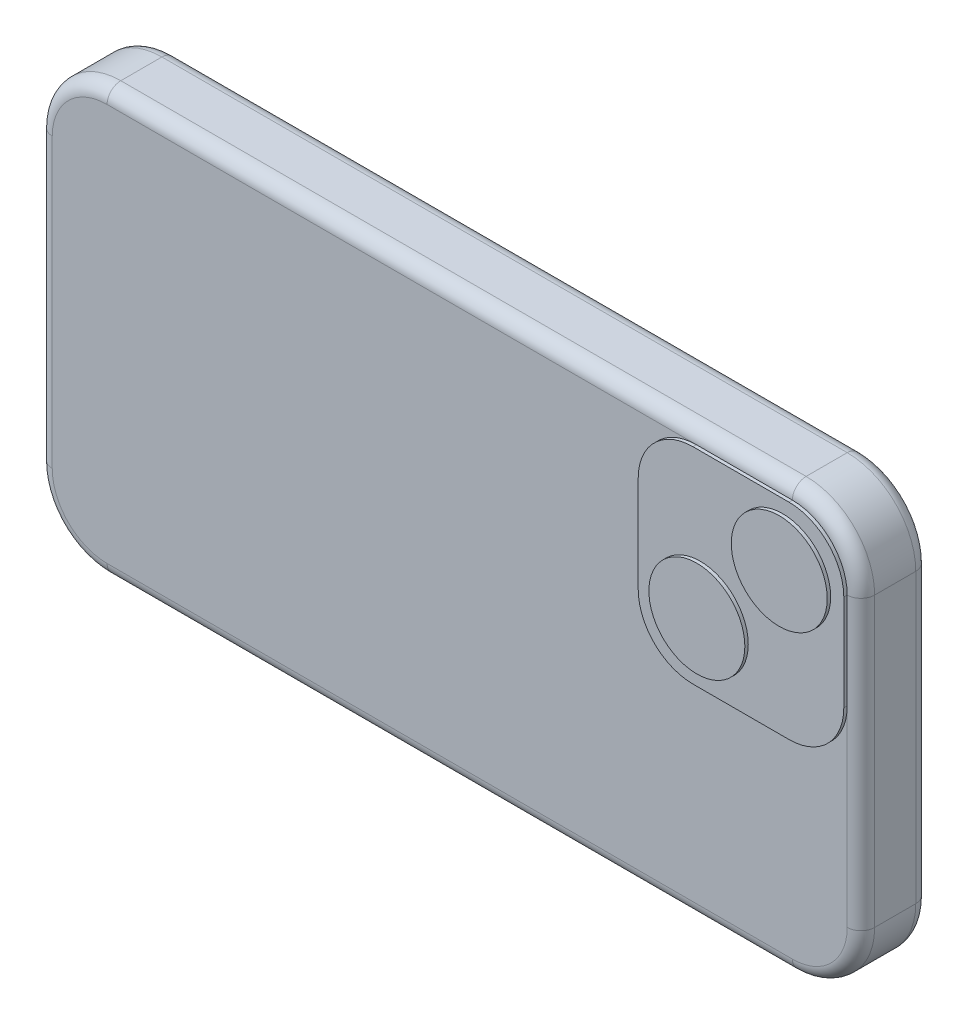
ISO-10303-21;
HEADER;
FILE_DESCRIPTION(('STEP AP214'),'2;1');
FILE_NAME('part.step','',(''),(''),'','','');
FILE_SCHEMA(('AUTOMOTIVE_DESIGN { 1 0 10303 214 1 1 1 1 }'));
ENDSEC;
DATA;
#1=APPLICATION_CONTEXT('core data for automotive mechanical design processes');
#2=APPLICATION_PROTOCOL_DEFINITION('international standard','automotive_design',2000,#1);
#3=PRODUCT_CONTEXT('',#1,'mechanical');
#4=PRODUCT('Part','Part','',(#3));
#5=PRODUCT_RELATED_PRODUCT_CATEGORY('part','',(#4));
#6=PRODUCT_DEFINITION_FORMATION('','',#4);
#7=PRODUCT_DEFINITION_CONTEXT('part definition',#1,'design');
#8=PRODUCT_DEFINITION('design','',#6,#7);
#9=PRODUCT_DEFINITION_SHAPE('','',#8);
#10=(LENGTH_UNIT() NAMED_UNIT(*) SI_UNIT(.MILLI.,.METRE.));
#11=(NAMED_UNIT(*) PLANE_ANGLE_UNIT() SI_UNIT($,.RADIAN.));
#12=(NAMED_UNIT(*) SI_UNIT($,.STERADIAN.) SOLID_ANGLE_UNIT());
#13=UNCERTAINTY_MEASURE_WITH_UNIT(LENGTH_MEASURE(1.E-05),#10,'distance_accuracy_value','');
#14=(GEOMETRIC_REPRESENTATION_CONTEXT(3) GLOBAL_UNCERTAINTY_ASSIGNED_CONTEXT((#13)) GLOBAL_UNIT_ASSIGNED_CONTEXT((#10,
#11,#12)) REPRESENTATION_CONTEXT('',''));
#15=CARTESIAN_POINT('',(0.,0.,0.));
#16=DIRECTION('',(0.,0.,1.));
#17=DIRECTION('',(1.,0.,0.));
#18=AXIS2_PLACEMENT_3D('',#15,#16,#17);
#19=CARTESIAN_POINT('',(76.2,-39.37,6.35));
#20=DIRECTION('',(-1.,0.,0.));
#21=DIRECTION('',(0.,0.,1.));
#22=AXIS2_PLACEMENT_3D('',#19,#20,#21);
#23=PLANE('',#22);
#24=DIRECTION('',(0.,0.,-1.));
#25=VECTOR('',#24,1.);
#26=CARTESIAN_POINT('',(76.2,-26.67,6.35));
#27=LINE('',#26,#25);
#28=CARTESIAN_POINT('',(76.2,-26.67,3.81));
#29=VERTEX_POINT('',#28);
#30=CARTESIAN_POINT('',(76.2,-26.67,-3.81));
#31=VERTEX_POINT('',#30);
#32=EDGE_CURVE('E249',#29,#31,#27,.T.);
#33=ORIENTED_EDGE('',*,*,#32,.T.);
#34=DIRECTION('',(0.,1.,0.));
#35=VECTOR('',#34,1.);
#36=CARTESIAN_POINT('',(76.2,26.67,-3.81));
#37=LINE('',#36,#35);
#38=CARTESIAN_POINT('',(76.2,26.67,-3.81));
#39=VERTEX_POINT('',#38);
#40=EDGE_CURVE('E333',#31,#39,#37,.T.);
#41=ORIENTED_EDGE('',*,*,#40,.T.);
#42=DIRECTION('',(0.,0.,-1.));
#43=VECTOR('',#42,1.);
#44=CARTESIAN_POINT('',(76.2,26.67,6.35));
#45=LINE('',#44,#43);
#46=CARTESIAN_POINT('',(76.2,26.67,3.81));
#47=VERTEX_POINT('',#46);
#48=EDGE_CURVE('E253',#39,#47,#45,.F.);
#49=ORIENTED_EDGE('',*,*,#48,.T.);
#50=DIRECTION('',(0.,1.,0.));
#51=VECTOR('',#50,1.);
#52=CARTESIAN_POINT('',(76.2,-39.37,3.81));
#53=LINE('',#52,#51);
#54=EDGE_CURVE('E330',#47,#29,#53,.F.);
#55=ORIENTED_EDGE('',*,*,#54,.T.);
#56=EDGE_LOOP('',(#33,#41,#49,#55));
#57=FACE_BOUND('',#56,.T.);
#58=ADVANCED_FACE('F47',(#57),#23,.F.);
#59=CARTESIAN_POINT('',(-76.2,39.37,6.35));
#60=DIRECTION('',(0.,-1.,0.));
#61=DIRECTION('',(0.,0.,-1.));
#62=AXIS2_PLACEMENT_3D('',#59,#60,#61);
#63=PLANE('',#62);
#64=DIRECTION('',(0.,0.,-1.));
#65=VECTOR('',#64,1.);
#66=CARTESIAN_POINT('',(63.5,39.37,6.35));
#67=LINE('',#66,#65);
#68=CARTESIAN_POINT('',(63.5,39.37,3.81));
#69=VERTEX_POINT('',#68);
#70=CARTESIAN_POINT('',(63.5,39.37,-3.81));
#71=VERTEX_POINT('',#70);
#72=EDGE_CURVE('E244',#69,#71,#67,.T.);
#73=ORIENTED_EDGE('',*,*,#72,.T.);
#74=DIRECTION('',(-1.,0.,0.));
#75=VECTOR('',#74,1.);
#76=CARTESIAN_POINT('',(-63.5,39.37,-3.81));
#77=LINE('',#76,#75);
#78=CARTESIAN_POINT('',(-63.5,39.37,-3.81));
#79=VERTEX_POINT('',#78);
#80=EDGE_CURVE('E345',#71,#79,#77,.T.);
#81=ORIENTED_EDGE('',*,*,#80,.T.);
#82=DIRECTION('',(0.,0.,-1.));
#83=VECTOR('',#82,1.);
#84=CARTESIAN_POINT('',(-63.5,39.37,6.35));
#85=LINE('',#84,#83);
#86=CARTESIAN_POINT('',(-63.5,39.37,3.81));
#87=VERTEX_POINT('',#86);
#88=EDGE_CURVE('E240',#79,#87,#85,.F.);
#89=ORIENTED_EDGE('',*,*,#88,.T.);
#90=DIRECTION('',(-1.,0.,0.));
#91=VECTOR('',#90,1.);
#92=CARTESIAN_POINT('',(-76.2,39.37,3.81));
#93=LINE('',#92,#91);
#94=EDGE_CURVE('E342',#87,#69,#93,.F.);
#95=ORIENTED_EDGE('',*,*,#94,.T.);
#96=EDGE_LOOP('',(#73,#81,#89,#95));
#97=FACE_BOUND('',#96,.T.);
#98=ADVANCED_FACE('F586',(#97),#63,.F.);
#99=CARTESIAN_POINT('',(-76.2,-39.37,6.35));
#100=DIRECTION('',(1.,0.,0.));
#101=DIRECTION('',(0.,0.,-1.));
#102=AXIS2_PLACEMENT_3D('',#99,#100,#101);
#103=PLANE('',#102);
#104=DIRECTION('',(0.,0.,-1.));
#105=VECTOR('',#104,1.);
#106=CARTESIAN_POINT('',(-76.2,26.67,6.35));
#107=LINE('',#106,#105);
#108=CARTESIAN_POINT('',(-76.2,26.67,3.81));
#109=VERTEX_POINT('',#108);
#110=CARTESIAN_POINT('',(-76.2,26.67,-3.81));
#111=VERTEX_POINT('',#110);
#112=EDGE_CURVE('E265',#109,#111,#107,.T.);
#113=ORIENTED_EDGE('',*,*,#112,.T.);
#114=DIRECTION('',(0.,-1.,0.));
#115=VECTOR('',#114,1.);
#116=CARTESIAN_POINT('',(-76.2,-26.67,-3.81));
#117=LINE('',#116,#115);
#118=CARTESIAN_POINT('',(-76.2,-26.67,-3.81));
#119=VERTEX_POINT('',#118);
#120=EDGE_CURVE('E308',#111,#119,#117,.T.);
#121=ORIENTED_EDGE('',*,*,#120,.T.);
#122=DIRECTION('',(0.,0.,-1.));
#123=VECTOR('',#122,1.);
#124=CARTESIAN_POINT('',(-76.2,-26.67,6.35));
#125=LINE('',#124,#123);
#126=CARTESIAN_POINT('',(-76.2,-26.67,3.81));
#127=VERTEX_POINT('',#126);
#128=EDGE_CURVE('E269',#119,#127,#125,.F.);
#129=ORIENTED_EDGE('',*,*,#128,.T.);
#130=DIRECTION('',(0.,-1.,0.));
#131=VECTOR('',#130,1.);
#132=CARTESIAN_POINT('',(-76.2,-39.37,3.81));
#133=LINE('',#132,#131);
#134=EDGE_CURVE('E305',#127,#109,#133,.F.);
#135=ORIENTED_EDGE('',*,*,#134,.T.);
#136=EDGE_LOOP('',(#113,#121,#129,#135));
#137=FACE_BOUND('',#136,.T.);
#138=ADVANCED_FACE('F606',(#137),#103,.F.);
#139=CARTESIAN_POINT('',(-76.2,-39.37,6.35));
#140=DIRECTION('',(0.,1.,0.));
#141=DIRECTION('',(0.,0.,1.));
#142=AXIS2_PLACEMENT_3D('',#139,#140,#141);
#143=PLANE('',#142);
#144=DIRECTION('',(0.,0.,-1.));
#145=VECTOR('',#144,1.);
#146=CARTESIAN_POINT('',(-63.5,-39.37,6.35));
#147=LINE('',#146,#145);
#148=CARTESIAN_POINT('',(-63.5,-39.37,3.81));
#149=VERTEX_POINT('',#148);
#150=CARTESIAN_POINT('',(-63.5,-39.37,-3.81));
#151=VERTEX_POINT('',#150);
#152=EDGE_CURVE('E257',#149,#151,#147,.T.);
#153=ORIENTED_EDGE('',*,*,#152,.T.);
#154=DIRECTION('',(1.,0.,0.));
#155=VECTOR('',#154,1.);
#156=CARTESIAN_POINT('',(63.4999999999999,-39.37,-3.81));
#157=LINE('',#156,#155);
#158=CARTESIAN_POINT('',(63.5,-39.37,-3.81));
#159=VERTEX_POINT('',#158);
#160=EDGE_CURVE('E320',#151,#159,#157,.T.);
#161=ORIENTED_EDGE('',*,*,#160,.T.);
#162=DIRECTION('',(0.,0.,-1.));
#163=VECTOR('',#162,1.);
#164=CARTESIAN_POINT('',(63.5,-39.37,6.35));
#165=LINE('',#164,#163);
#166=CARTESIAN_POINT('',(63.5,-39.37,3.81));
#167=VERTEX_POINT('',#166);
#168=EDGE_CURVE('E261',#159,#167,#165,.F.);
#169=ORIENTED_EDGE('',*,*,#168,.T.);
#170=DIRECTION('',(1.,0.,0.));
#171=VECTOR('',#170,1.);
#172=CARTESIAN_POINT('',(-76.2,-39.37,3.81));
#173=LINE('',#172,#171);
#174=EDGE_CURVE('E317',#167,#149,#173,.F.);
#175=ORIENTED_EDGE('',*,*,#174,.T.);
#176=EDGE_LOOP('',(#153,#161,#169,#175));
#177=FACE_BOUND('',#176,.T.);
#178=ADVANCED_FACE('F872',(#177),#143,.F.);
#179=CARTESIAN_POINT('',(0.,0.,6.35));
#180=DIRECTION('',(0.,0.,-1.));
#181=DIRECTION('',(-1.,0.,0.));
#182=AXIS2_PLACEMENT_3D('',#179,#180,#181);
#183=PLANE('',#182);
#184=CARTESIAN_POINT('',(45.72,26.67,6.35));
#185=DIRECTION('',(0.,0.,-1.));
#186=DIRECTION('',(-1.,0.,0.));
#187=AXIS2_PLACEMENT_3D('',#184,#185,#186);
#188=CIRCLE('',#187,10.16);
#189=CARTESIAN_POINT('',(45.72,36.83,6.35));
#190=VERTEX_POINT('',#189);
#191=CARTESIAN_POINT('',(35.56,26.6699999999999,6.35));
#192=VERTEX_POINT('',#191);
#193=EDGE_CURVE('E231',#190,#192,#188,.F.);
#194=ORIENTED_EDGE('',*,*,#193,.F.);
#195=DIRECTION('',(-1.,0.,0.));
#196=VECTOR('',#195,1.);
#197=CARTESIAN_POINT('',(0.,36.83,6.35));
#198=LINE('',#197,#196);
#199=CARTESIAN_POINT('',(-63.5,36.83,6.35));
#200=VERTEX_POINT('',#199);
#201=EDGE_CURVE('E357',#190,#200,#198,.T.);
#202=ORIENTED_EDGE('',*,*,#201,.T.);
#203=CARTESIAN_POINT('',(-63.5,26.67,6.35));
#204=DIRECTION('',(0.,0.,-1.));
#205=DIRECTION('',(-1.,0.,0.));
#206=AXIS2_PLACEMENT_3D('',#203,#204,#205);
#207=CIRCLE('',#206,10.16);
#208=CARTESIAN_POINT('',(-73.66,26.67,6.35));
#209=VERTEX_POINT('',#208);
#210=EDGE_CURVE('E360',#200,#209,#207,.F.);
#211=ORIENTED_EDGE('',*,*,#210,.T.);
#212=DIRECTION('',(0.,-1.,0.));
#213=VECTOR('',#212,1.);
#214=CARTESIAN_POINT('',(-73.66,0.,6.35));
#215=LINE('',#214,#213);
#216=CARTESIAN_POINT('',(-73.66,-26.67,6.35));
#217=VERTEX_POINT('',#216);
#218=EDGE_CURVE('E363',#209,#217,#215,.T.);
#219=ORIENTED_EDGE('',*,*,#218,.T.);
#220=CARTESIAN_POINT('',(-63.5,-26.67,6.35));
#221=DIRECTION('',(0.,0.,-1.));
#222=DIRECTION('',(-1.,0.,0.));
#223=AXIS2_PLACEMENT_3D('',#220,#221,#222);
#224=CIRCLE('',#223,10.16);
#225=CARTESIAN_POINT('',(-63.5,-36.83,6.35));
#226=VERTEX_POINT('',#225);
#227=EDGE_CURVE('E366',#217,#226,#224,.F.);
#228=ORIENTED_EDGE('',*,*,#227,.T.);
#229=DIRECTION('',(1.,0.,0.));
#230=VECTOR('',#229,1.);
#231=CARTESIAN_POINT('',(0.,-36.83,6.35));
#232=LINE('',#231,#230);
#233=CARTESIAN_POINT('',(63.5,-36.83,6.35));
#234=VERTEX_POINT('',#233);
#235=EDGE_CURVE('E369',#226,#234,#232,.T.);
#236=ORIENTED_EDGE('',*,*,#235,.T.);
#237=CARTESIAN_POINT('',(63.5,-26.67,6.35));
#238=DIRECTION('',(0.,0.,-1.));
#239=DIRECTION('',(-1.,0.,0.));
#240=AXIS2_PLACEMENT_3D('',#237,#238,#239);
#241=CIRCLE('',#240,10.16);
#242=CARTESIAN_POINT('',(73.66,-26.67,6.35));
#243=VERTEX_POINT('',#242);
#244=EDGE_CURVE('E372',#234,#243,#241,.F.);
#245=ORIENTED_EDGE('',*,*,#244,.T.);
#246=DIRECTION('',(0.,1.,0.));
#247=VECTOR('',#246,1.);
#248=CARTESIAN_POINT('',(73.66,0.,6.35));
#249=LINE('',#248,#247);
#250=CARTESIAN_POINT('',(73.66,8.89000000000007,6.35));
#251=VERTEX_POINT('',#250);
#252=EDGE_CURVE('E349',#243,#251,#249,.T.);
#253=ORIENTED_EDGE('',*,*,#252,.T.);
#254=CARTESIAN_POINT('',(63.5,8.89000000000001,6.35));
#255=DIRECTION('',(0.,0.,-1.));
#256=DIRECTION('',(-1.,0.,0.));
#257=AXIS2_PLACEMENT_3D('',#254,#255,#256);
#258=CIRCLE('',#257,10.16);
#259=CARTESIAN_POINT('',(63.4999999999999,-1.27,6.35));
#260=VERTEX_POINT('',#259);
#261=EDGE_CURVE('E227',#251,#260,#258,.T.);
#262=ORIENTED_EDGE('',*,*,#261,.T.);
#263=DIRECTION('',(-1.,0.,0.));
#264=VECTOR('',#263,1.);
#265=CARTESIAN_POINT('',(0.,-1.27,6.35));
#266=LINE('',#265,#264);
#267=CARTESIAN_POINT('',(45.72,-1.27,6.35));
#268=VERTEX_POINT('',#267);
#269=EDGE_CURVE('E376',#260,#268,#266,.T.);
#270=ORIENTED_EDGE('',*,*,#269,.T.);
#271=CARTESIAN_POINT('',(45.72,8.89,6.35));
#272=DIRECTION('',(0.,0.,-1.));
#273=DIRECTION('',(-1.,0.,0.));
#274=AXIS2_PLACEMENT_3D('',#271,#272,#273);
#275=CIRCLE('',#274,10.16);
#276=CARTESIAN_POINT('',(35.56,8.89,6.35));
#277=VERTEX_POINT('',#276);
#278=EDGE_CURVE('E57',#277,#268,#275,.F.);
#279=ORIENTED_EDGE('',*,*,#278,.F.);
#280=DIRECTION('',(0.,-1.,0.));
#281=VECTOR('',#280,1.);
#282=CARTESIAN_POINT('',(35.56,0.,6.35));
#283=LINE('',#282,#281);
#284=EDGE_CURVE('E11',#192,#277,#283,.T.);
#285=ORIENTED_EDGE('',*,*,#284,.F.);
#286=EDGE_LOOP('',(#194,#202,#211,#219,#228,#236,#245,#253,#262,#270,#279,#285));
#287=FACE_BOUND('',#286,.T.);
#288=ADVANCED_FACE('F527',(#287),#183,.F.);
#289=CARTESIAN_POINT('',(0.,0.,-6.35));
#290=DIRECTION('',(0.,0.,-1.));
#291=DIRECTION('',(-1.,0.,0.));
#292=AXIS2_PLACEMENT_3D('',#289,#290,#291);
#293=PLANE('',#292);
#294=DIRECTION('',(0.,-1.,0.));
#295=VECTOR('',#294,1.);
#296=CARTESIAN_POINT('',(-73.66,26.67,-6.35));
#297=LINE('',#296,#295);
#298=CARTESIAN_POINT('',(-73.66,-26.67,-6.35));
#299=VERTEX_POINT('',#298);
#300=CARTESIAN_POINT('',(-73.66,26.67,-6.35));
#301=VERTEX_POINT('',#300);
#302=EDGE_CURVE('E291',#299,#301,#297,.F.);
#303=ORIENTED_EDGE('',*,*,#302,.T.);
#304=CARTESIAN_POINT('',(-63.5,26.67,-6.35));
#305=DIRECTION('',(0.,0.,-1.));
#306=DIRECTION('',(-1.,0.,0.));
#307=AXIS2_PLACEMENT_3D('',#304,#305,#306);
#308=CIRCLE('',#307,10.16);
#309=CARTESIAN_POINT('',(-63.5,36.83,-6.35));
#310=VERTEX_POINT('',#309);
#311=EDGE_CURVE('E294',#301,#310,#308,.T.);
#312=ORIENTED_EDGE('',*,*,#311,.T.);
#313=DIRECTION('',(-1.,0.,0.));
#314=VECTOR('',#313,1.);
#315=CARTESIAN_POINT('',(63.4999999999999,36.83,-6.35));
#316=LINE('',#315,#314);
#317=CARTESIAN_POINT('',(63.5,36.83,-6.35));
#318=VERTEX_POINT('',#317);
#319=EDGE_CURVE('E273',#310,#318,#316,.F.);
#320=ORIENTED_EDGE('',*,*,#319,.T.);
#321=CARTESIAN_POINT('',(63.5,26.67,-6.35));
#322=DIRECTION('',(0.,0.,-1.));
#323=DIRECTION('',(-1.,0.,0.));
#324=AXIS2_PLACEMENT_3D('',#321,#322,#323);
#325=CIRCLE('',#324,10.16);
#326=CARTESIAN_POINT('',(73.66,26.67,-6.35));
#327=VERTEX_POINT('',#326);
#328=EDGE_CURVE('E276',#318,#327,#325,.T.);
#329=ORIENTED_EDGE('',*,*,#328,.T.);
#330=DIRECTION('',(0.,1.,0.));
#331=VECTOR('',#330,1.);
#332=CARTESIAN_POINT('',(73.66,-26.67,-6.35));
#333=LINE('',#332,#331);
#334=CARTESIAN_POINT('',(73.66,-26.67,-6.35));
#335=VERTEX_POINT('',#334);
#336=EDGE_CURVE('E279',#327,#335,#333,.F.);
#337=ORIENTED_EDGE('',*,*,#336,.T.);
#338=CARTESIAN_POINT('',(63.5,-26.67,-6.35));
#339=DIRECTION('',(0.,0.,-1.));
#340=DIRECTION('',(-1.,0.,0.));
#341=AXIS2_PLACEMENT_3D('',#338,#339,#340);
#342=CIRCLE('',#341,10.16);
#343=CARTESIAN_POINT('',(63.5,-36.83,-6.35));
#344=VERTEX_POINT('',#343);
#345=EDGE_CURVE('E282',#335,#344,#342,.T.);
#346=ORIENTED_EDGE('',*,*,#345,.T.);
#347=DIRECTION('',(1.,0.,0.));
#348=VECTOR('',#347,1.);
#349=CARTESIAN_POINT('',(-63.5,-36.83,-6.35));
#350=LINE('',#349,#348);
#351=CARTESIAN_POINT('',(-63.5,-36.83,-6.35));
#352=VERTEX_POINT('',#351);
#353=EDGE_CURVE('E285',#344,#352,#350,.F.);
#354=ORIENTED_EDGE('',*,*,#353,.T.);
#355=CARTESIAN_POINT('',(-63.5,-26.67,-6.35));
#356=DIRECTION('',(0.,0.,-1.));
#357=DIRECTION('',(-1.,0.,0.));
#358=AXIS2_PLACEMENT_3D('',#355,#356,#357);
#359=CIRCLE('',#358,10.16);
#360=EDGE_CURVE('E288',#352,#299,#359,.T.);
#361=ORIENTED_EDGE('',*,*,#360,.T.);
#362=EDGE_LOOP('',(#303,#312,#320,#329,#337,#346,#354,#361));
#363=FACE_BOUND('',#362,.T.);
#364=ADVANCED_FACE('F574',(#363),#293,.T.);
#365=CARTESIAN_POINT('',(63.5,26.67,6.35));
#366=DIRECTION('',(0.,0.,-1.));
#367=DIRECTION('',(-1.,0.,0.));
#368=AXIS2_PLACEMENT_3D('',#365,#366,#367);
#369=CYLINDRICAL_SURFACE('',#368,12.7);
#370=ORIENTED_EDGE('',*,*,#48,.F.);
#371=CARTESIAN_POINT('',(63.5,26.67,-3.81));
#372=DIRECTION('',(0.,0.,-1.));
#373=DIRECTION('',(-1.,0.,0.));
#374=AXIS2_PLACEMENT_3D('',#371,#372,#373);
#375=CIRCLE('',#374,12.7);
#376=EDGE_CURVE('E339',#39,#71,#375,.F.);
#377=ORIENTED_EDGE('',*,*,#376,.T.);
#378=ORIENTED_EDGE('',*,*,#72,.F.);
#379=CARTESIAN_POINT('',(63.5,26.67,3.81));
#380=DIRECTION('',(0.,0.,-1.));
#381=DIRECTION('',(-1.,0.,0.));
#382=AXIS2_PLACEMENT_3D('',#379,#380,#381);
#383=CIRCLE('',#382,12.7);
#384=EDGE_CURVE('E336',#69,#47,#383,.T.);
#385=ORIENTED_EDGE('',*,*,#384,.T.);
#386=EDGE_LOOP('',(#370,#377,#378,#385));
#387=FACE_BOUND('',#386,.T.);
#388=ADVANCED_FACE('F582',(#387),#369,.T.);
#389=CARTESIAN_POINT('',(63.5,-26.67,6.35));
#390=DIRECTION('',(0.,0.,-1.));
#391=DIRECTION('',(-1.,0.,0.));
#392=AXIS2_PLACEMENT_3D('',#389,#390,#391);
#393=CYLINDRICAL_SURFACE('',#392,12.7);
#394=ORIENTED_EDGE('',*,*,#168,.F.);
#395=CARTESIAN_POINT('',(63.5,-26.67,-3.81));
#396=DIRECTION('',(0.,0.,-1.));
#397=DIRECTION('',(-1.,0.,0.));
#398=AXIS2_PLACEMENT_3D('',#395,#396,#397);
#399=CIRCLE('',#398,12.7);
#400=EDGE_CURVE('E327',#159,#31,#399,.F.);
#401=ORIENTED_EDGE('',*,*,#400,.T.);
#402=ORIENTED_EDGE('',*,*,#32,.F.);
#403=CARTESIAN_POINT('',(63.5,-26.67,3.81));
#404=DIRECTION('',(0.,0.,-1.));
#405=DIRECTION('',(-1.,0.,0.));
#406=AXIS2_PLACEMENT_3D('',#403,#404,#405);
#407=CIRCLE('',#406,12.7);
#408=EDGE_CURVE('E323',#29,#167,#407,.T.);
#409=ORIENTED_EDGE('',*,*,#408,.T.);
#410=EDGE_LOOP('',(#394,#401,#402,#409));
#411=FACE_BOUND('',#410,.T.);
#412=ADVANCED_FACE('F560',(#411),#393,.T.);
#413=CARTESIAN_POINT('',(-63.5,-26.67,6.35));
#414=DIRECTION('',(0.,0.,-1.));
#415=DIRECTION('',(-1.,0.,0.));
#416=AXIS2_PLACEMENT_3D('',#413,#414,#415);
#417=CYLINDRICAL_SURFACE('',#416,12.7);
#418=ORIENTED_EDGE('',*,*,#128,.F.);
#419=CARTESIAN_POINT('',(-63.5,-26.67,-3.81));
#420=DIRECTION('',(0.,0.,-1.));
#421=DIRECTION('',(-1.,0.,0.));
#422=AXIS2_PLACEMENT_3D('',#419,#420,#421);
#423=CIRCLE('',#422,12.7);
#424=EDGE_CURVE('E314',#119,#151,#423,.F.);
#425=ORIENTED_EDGE('',*,*,#424,.T.);
#426=ORIENTED_EDGE('',*,*,#152,.F.);
#427=CARTESIAN_POINT('',(-63.5,-26.67,3.81));
#428=DIRECTION('',(0.,0.,-1.));
#429=DIRECTION('',(-1.,0.,0.));
#430=AXIS2_PLACEMENT_3D('',#427,#428,#429);
#431=CIRCLE('',#430,12.7);
#432=EDGE_CURVE('E311',#149,#127,#431,.T.);
#433=ORIENTED_EDGE('',*,*,#432,.T.);
#434=EDGE_LOOP('',(#418,#425,#426,#433));
#435=FACE_BOUND('',#434,.T.);
#436=ADVANCED_FACE('F610',(#435),#417,.T.);
#437=CARTESIAN_POINT('',(-63.5,26.67,6.35));
#438=DIRECTION('',(0.,0.,-1.));
#439=DIRECTION('',(-1.,0.,0.));
#440=AXIS2_PLACEMENT_3D('',#437,#438,#439);
#441=CYLINDRICAL_SURFACE('',#440,12.7);
#442=ORIENTED_EDGE('',*,*,#88,.F.);
#443=CARTESIAN_POINT('',(-63.5,26.67,-3.81));
#444=DIRECTION('',(0.,0.,-1.));
#445=DIRECTION('',(-1.,0.,0.));
#446=AXIS2_PLACEMENT_3D('',#443,#444,#445);
#447=CIRCLE('',#446,12.7);
#448=EDGE_CURVE('E301',#79,#111,#447,.F.);
#449=ORIENTED_EDGE('',*,*,#448,.T.);
#450=ORIENTED_EDGE('',*,*,#112,.F.);
#451=CARTESIAN_POINT('',(-63.5,26.67,3.81));
#452=DIRECTION('',(0.,0.,-1.));
#453=DIRECTION('',(-1.,0.,0.));
#454=AXIS2_PLACEMENT_3D('',#451,#452,#453);
#455=CIRCLE('',#454,12.7);
#456=EDGE_CURVE('E298',#109,#87,#455,.T.);
#457=ORIENTED_EDGE('',*,*,#456,.T.);
#458=EDGE_LOOP('',(#442,#449,#450,#457));
#459=FACE_BOUND('',#458,.T.);
#460=ADVANCED_FACE('F604',(#459),#441,.T.);
#461=CARTESIAN_POINT('',(63.5,-26.67,-3.81));
#462=DIRECTION('',(0.,0.,-1.));
#463=DIRECTION('',(-1.,0.,0.));
#464=AXIS2_PLACEMENT_3D('',#461,#462,#463);
#465=TOROIDAL_SURFACE('',#464,10.16,2.54);
#466=CARTESIAN_POINT('',(73.66,-26.67,-3.81));
#467=DIRECTION('',(0.,1.,0.));
#468=DIRECTION('',(0.,0.,1.));
#469=AXIS2_PLACEMENT_3D('',#466,#467,#468);
#470=CIRCLE('',#469,2.54);
#471=EDGE_CURVE('E400',#31,#335,#470,.T.);
#472=ORIENTED_EDGE('',*,*,#471,.F.);
#473=ORIENTED_EDGE('',*,*,#400,.F.);
#474=CARTESIAN_POINT('',(63.5,-36.83,-3.81));
#475=DIRECTION('',(-1.,0.,0.));
#476=DIRECTION('',(0.,0.,1.));
#477=AXIS2_PLACEMENT_3D('',#474,#475,#476);
#478=CIRCLE('',#477,2.54);
#479=EDGE_CURVE('E245',#344,#159,#478,.T.);
#480=ORIENTED_EDGE('',*,*,#479,.F.);
#481=ORIENTED_EDGE('',*,*,#345,.F.);
#482=EDGE_LOOP('',(#472,#473,#480,#481));
#483=FACE_BOUND('',#482,.T.);
#484=ADVANCED_FACE('F564',(#483),#465,.T.);
#485=CARTESIAN_POINT('',(-76.2,-36.83,-3.81));
#486=DIRECTION('',(-1.,0.,0.));
#487=DIRECTION('',(0.,0.,1.));
#488=AXIS2_PLACEMENT_3D('',#485,#486,#487);
#489=CYLINDRICAL_SURFACE('',#488,2.54);
#490=ORIENTED_EDGE('',*,*,#479,.T.);
#491=ORIENTED_EDGE('',*,*,#160,.F.);
#492=CARTESIAN_POINT('',(-63.5,-36.83,-3.81));
#493=DIRECTION('',(-1.,0.,0.));
#494=DIRECTION('',(0.,0.,1.));
#495=AXIS2_PLACEMENT_3D('',#492,#493,#494);
#496=CIRCLE('',#495,2.54);
#497=EDGE_CURVE('E396',#352,#151,#496,.T.);
#498=ORIENTED_EDGE('',*,*,#497,.F.);
#499=ORIENTED_EDGE('',*,*,#353,.F.);
#500=EDGE_LOOP('',(#490,#491,#498,#499));
#501=FACE_BOUND('',#500,.T.);
#502=ADVANCED_FACE('F570',(#501),#489,.T.);
#503=CARTESIAN_POINT('',(73.66,-39.37,-3.81));
#504=DIRECTION('',(0.,-1.,0.));
#505=DIRECTION('',(0.,0.,-1.));
#506=AXIS2_PLACEMENT_3D('',#503,#504,#505);
#507=CYLINDRICAL_SURFACE('',#506,2.54);
#508=ORIENTED_EDGE('',*,*,#471,.T.);
#509=ORIENTED_EDGE('',*,*,#336,.F.);
#510=CARTESIAN_POINT('',(73.66,26.67,-3.81));
#511=DIRECTION('',(0.,1.,0.));
#512=DIRECTION('',(0.,0.,1.));
#513=AXIS2_PLACEMENT_3D('',#510,#511,#512);
#514=CIRCLE('',#513,2.54);
#515=EDGE_CURVE('E392',#39,#327,#514,.T.);
#516=ORIENTED_EDGE('',*,*,#515,.F.);
#517=ORIENTED_EDGE('',*,*,#40,.F.);
#518=EDGE_LOOP('',(#508,#509,#516,#517));
#519=FACE_BOUND('',#518,.T.);
#520=ADVANCED_FACE('F578',(#519),#507,.T.);
#521=CARTESIAN_POINT('',(-63.5,-26.67,-3.81));
#522=DIRECTION('',(0.,0.,-1.));
#523=DIRECTION('',(-1.,0.,0.));
#524=AXIS2_PLACEMENT_3D('',#521,#522,#523);
#525=TOROIDAL_SURFACE('',#524,10.16,2.54);
#526=ORIENTED_EDGE('',*,*,#497,.T.);
#527=ORIENTED_EDGE('',*,*,#424,.F.);
#528=CARTESIAN_POINT('',(-73.66,-26.67,-3.81));
#529=DIRECTION('',(0.,1.,0.));
#530=DIRECTION('',(0.,0.,1.));
#531=AXIS2_PLACEMENT_3D('',#528,#529,#530);
#532=CIRCLE('',#531,2.54);
#533=EDGE_CURVE('E388',#299,#119,#532,.T.);
#534=ORIENTED_EDGE('',*,*,#533,.F.);
#535=ORIENTED_EDGE('',*,*,#360,.F.);
#536=EDGE_LOOP('',(#526,#527,#534,#535));
#537=FACE_BOUND('',#536,.T.);
#538=ADVANCED_FACE('F613',(#537),#525,.T.);
#539=CARTESIAN_POINT('',(63.5,26.67,-3.81));
#540=DIRECTION('',(0.,0.,-1.));
#541=DIRECTION('',(-1.,0.,0.));
#542=AXIS2_PLACEMENT_3D('',#539,#540,#541);
#543=TOROIDAL_SURFACE('',#542,10.16,2.54);
#544=ORIENTED_EDGE('',*,*,#515,.T.);
#545=ORIENTED_EDGE('',*,*,#328,.F.);
#546=CARTESIAN_POINT('',(63.5,36.83,-3.81));
#547=DIRECTION('',(-1.,0.,0.));
#548=DIRECTION('',(0.,0.,1.));
#549=AXIS2_PLACEMENT_3D('',#546,#547,#548);
#550=CIRCLE('',#549,2.54);
#551=EDGE_CURVE('E384',#71,#318,#550,.T.);
#552=ORIENTED_EDGE('',*,*,#551,.F.);
#553=ORIENTED_EDGE('',*,*,#376,.F.);
#554=EDGE_LOOP('',(#544,#545,#552,#553));
#555=FACE_BOUND('',#554,.T.);
#556=ADVANCED_FACE('F591',(#555),#543,.T.);
#557=CARTESIAN_POINT('',(-73.66,-39.37,-3.81));
#558=DIRECTION('',(0.,1.,0.));
#559=DIRECTION('',(0.,0.,1.));
#560=AXIS2_PLACEMENT_3D('',#557,#558,#559);
#561=CYLINDRICAL_SURFACE('',#560,2.54);
#562=ORIENTED_EDGE('',*,*,#533,.T.);
#563=ORIENTED_EDGE('',*,*,#120,.F.);
#564=CARTESIAN_POINT('',(-73.66,26.67,-3.81));
#565=DIRECTION('',(0.,1.,0.));
#566=DIRECTION('',(0.,0.,1.));
#567=AXIS2_PLACEMENT_3D('',#564,#565,#566);
#568=CIRCLE('',#567,2.54);
#569=EDGE_CURVE('E380',#301,#111,#568,.T.);
#570=ORIENTED_EDGE('',*,*,#569,.F.);
#571=ORIENTED_EDGE('',*,*,#302,.F.);
#572=EDGE_LOOP('',(#562,#563,#570,#571));
#573=FACE_BOUND('',#572,.T.);
#574=ADVANCED_FACE('F616',(#573),#561,.T.);
#575=CARTESIAN_POINT('',(-76.2,36.83,-3.81));
#576=DIRECTION('',(1.,0.,0.));
#577=DIRECTION('',(0.,0.,-1.));
#578=AXIS2_PLACEMENT_3D('',#575,#576,#577);
#579=CYLINDRICAL_SURFACE('',#578,2.54);
#580=ORIENTED_EDGE('',*,*,#551,.T.);
#581=ORIENTED_EDGE('',*,*,#319,.F.);
#582=CARTESIAN_POINT('',(-63.5,36.83,-3.81));
#583=DIRECTION('',(-1.,0.,0.));
#584=DIRECTION('',(0.,0.,1.));
#585=AXIS2_PLACEMENT_3D('',#582,#583,#584);
#586=CIRCLE('',#585,2.54);
#587=EDGE_CURVE('E377',#79,#310,#586,.T.);
#588=ORIENTED_EDGE('',*,*,#587,.F.);
#589=ORIENTED_EDGE('',*,*,#80,.F.);
#590=EDGE_LOOP('',(#580,#581,#588,#589));
#591=FACE_BOUND('',#590,.T.);
#592=ADVANCED_FACE('F595',(#591),#579,.T.);
#593=CARTESIAN_POINT('',(-63.5,26.67,-3.81));
#594=DIRECTION('',(0.,0.,-1.));
#595=DIRECTION('',(-1.,0.,0.));
#596=AXIS2_PLACEMENT_3D('',#593,#594,#595);
#597=TOROIDAL_SURFACE('',#596,10.16,2.54);
#598=ORIENTED_EDGE('',*,*,#569,.T.);
#599=ORIENTED_EDGE('',*,*,#448,.F.);
#600=ORIENTED_EDGE('',*,*,#587,.T.);
#601=ORIENTED_EDGE('',*,*,#311,.F.);
#602=EDGE_LOOP('',(#598,#599,#600,#601));
#603=FACE_BOUND('',#602,.T.);
#604=ADVANCED_FACE('F599',(#603),#597,.T.);
#605=CARTESIAN_POINT('',(-63.5,26.67,3.81));
#606=DIRECTION('',(0.,0.,-1.));
#607=DIRECTION('',(-1.,0.,0.));
#608=AXIS2_PLACEMENT_3D('',#605,#606,#607);
#609=TOROIDAL_SURFACE('',#608,10.16,2.54);
#610=CARTESIAN_POINT('',(-63.5,36.83,3.81));
#611=DIRECTION('',(1.,0.,0.));
#612=DIRECTION('',(0.,0.,-1.));
#613=AXIS2_PLACEMENT_3D('',#610,#611,#612);
#614=CIRCLE('',#613,2.54);
#615=EDGE_CURVE('E427',#87,#200,#614,.T.);
#616=ORIENTED_EDGE('',*,*,#615,.F.);
#617=ORIENTED_EDGE('',*,*,#456,.F.);
#618=CARTESIAN_POINT('',(-73.66,26.67,3.81));
#619=DIRECTION('',(0.,-1.,0.));
#620=DIRECTION('',(0.,0.,-1.));
#621=AXIS2_PLACEMENT_3D('',#618,#619,#620);
#622=CIRCLE('',#621,2.54);
#623=EDGE_CURVE('E381',#209,#109,#622,.T.);
#624=ORIENTED_EDGE('',*,*,#623,.F.);
#625=ORIENTED_EDGE('',*,*,#210,.F.);
#626=EDGE_LOOP('',(#616,#617,#624,#625));
#627=FACE_BOUND('',#626,.T.);
#628=ADVANCED_FACE('F49',(#627),#609,.T.);
#629=CARTESIAN_POINT('',(-73.66,0.,3.81));
#630=DIRECTION('',(0.,-1.,0.));
#631=DIRECTION('',(0.,0.,-1.));
#632=AXIS2_PLACEMENT_3D('',#629,#630,#631);
#633=CYLINDRICAL_SURFACE('',#632,2.54);
#634=ORIENTED_EDGE('',*,*,#623,.T.);
#635=ORIENTED_EDGE('',*,*,#134,.F.);
#636=CARTESIAN_POINT('',(-73.66,-26.67,3.81));
#637=DIRECTION('',(0.,-1.,0.));
#638=DIRECTION('',(0.,0.,-1.));
#639=AXIS2_PLACEMENT_3D('',#636,#637,#638);
#640=CIRCLE('',#639,2.54);
#641=EDGE_CURVE('E423',#217,#127,#640,.T.);
#642=ORIENTED_EDGE('',*,*,#641,.F.);
#643=ORIENTED_EDGE('',*,*,#218,.F.);
#644=EDGE_LOOP('',(#634,#635,#642,#643));
#645=FACE_BOUND('',#644,.T.);
#646=ADVANCED_FACE('F535',(#645),#633,.T.);
#647=CARTESIAN_POINT('',(0.,36.83,3.81));
#648=DIRECTION('',(-1.,0.,0.));
#649=DIRECTION('',(0.,0.,1.));
#650=AXIS2_PLACEMENT_3D('',#647,#648,#649);
#651=CYLINDRICAL_SURFACE('',#650,2.54);
#652=ORIENTED_EDGE('',*,*,#615,.T.);
#653=ORIENTED_EDGE('',*,*,#201,.F.);
#654=CARTESIAN_POINT('',(63.5,36.83,6.35));
#655=VERTEX_POINT('',#654);
#656=EDGE_CURVE('E225',#655,#190,#198,.T.);
#657=ORIENTED_EDGE('',*,*,#656,.F.);
#658=CARTESIAN_POINT('',(63.5,36.83,3.81));
#659=DIRECTION('',(1.,0.,0.));
#660=DIRECTION('',(0.,0.,-1.));
#661=AXIS2_PLACEMENT_3D('',#658,#659,#660);
#662=CIRCLE('',#661,2.54);
#663=EDGE_CURVE('E419',#69,#655,#662,.T.);
#664=ORIENTED_EDGE('',*,*,#663,.F.);
#665=ORIENTED_EDGE('',*,*,#94,.F.);
#666=EDGE_LOOP('',(#652,#653,#657,#664,#665));
#667=FACE_BOUND('',#666,.T.);
#668=ADVANCED_FACE('F521',(#667),#651,.T.);
#669=CARTESIAN_POINT('',(-63.5,-26.67,3.81));
#670=DIRECTION('',(0.,0.,-1.));
#671=DIRECTION('',(-1.,0.,0.));
#672=AXIS2_PLACEMENT_3D('',#669,#670,#671);
#673=TOROIDAL_SURFACE('',#672,10.16,2.54);
#674=ORIENTED_EDGE('',*,*,#641,.T.);
#675=ORIENTED_EDGE('',*,*,#432,.F.);
#676=CARTESIAN_POINT('',(-63.5,-36.83,3.81));
#677=DIRECTION('',(1.,0.,0.));
#678=DIRECTION('',(0.,0.,-1.));
#679=AXIS2_PLACEMENT_3D('',#676,#677,#678);
#680=CIRCLE('',#679,2.54);
#681=EDGE_CURVE('E415',#226,#149,#680,.T.);
#682=ORIENTED_EDGE('',*,*,#681,.F.);
#683=ORIENTED_EDGE('',*,*,#227,.F.);
#684=EDGE_LOOP('',(#674,#675,#682,#683));
#685=FACE_BOUND('',#684,.T.);
#686=ADVANCED_FACE('F542',(#685),#673,.T.);
#687=CARTESIAN_POINT('',(63.5,26.67,3.81));
#688=DIRECTION('',(0.,0.,-1.));
#689=DIRECTION('',(-1.,0.,0.));
#690=AXIS2_PLACEMENT_3D('',#687,#688,#689);
#691=TOROIDAL_SURFACE('',#690,10.16,2.54);
#692=ORIENTED_EDGE('',*,*,#663,.T.);
#693=CARTESIAN_POINT('',(63.5,26.67,6.35));
#694=DIRECTION('',(0.,0.,-1.));
#695=DIRECTION('',(-1.,0.,0.));
#696=AXIS2_PLACEMENT_3D('',#693,#694,#695);
#697=CIRCLE('',#696,10.16);
#698=CARTESIAN_POINT('',(73.66,26.67,6.35));
#699=VERTEX_POINT('',#698);
#700=EDGE_CURVE('E353',#699,#655,#697,.F.);
#701=ORIENTED_EDGE('',*,*,#700,.F.);
#702=CARTESIAN_POINT('',(73.66,26.67,3.81));
#703=DIRECTION('',(0.,-1.,0.));
#704=DIRECTION('',(0.,0.,-1.));
#705=AXIS2_PLACEMENT_3D('',#702,#703,#704);
#706=CIRCLE('',#705,2.54);
#707=EDGE_CURVE('E412',#47,#699,#706,.T.);
#708=ORIENTED_EDGE('',*,*,#707,.F.);
#709=ORIENTED_EDGE('',*,*,#384,.F.);
#710=EDGE_LOOP('',(#692,#701,#708,#709));
#711=FACE_BOUND('',#710,.T.);
#712=ADVANCED_FACE('F515',(#711),#691,.T.);
#713=CARTESIAN_POINT('',(0.,-36.83,3.81));
#714=DIRECTION('',(1.,0.,0.));
#715=DIRECTION('',(0.,0.,-1.));
#716=AXIS2_PLACEMENT_3D('',#713,#714,#715);
#717=CYLINDRICAL_SURFACE('',#716,2.54);
#718=ORIENTED_EDGE('',*,*,#681,.T.);
#719=ORIENTED_EDGE('',*,*,#174,.F.);
#720=CARTESIAN_POINT('',(63.5,-36.83,3.81));
#721=DIRECTION('',(1.,0.,0.));
#722=DIRECTION('',(0.,0.,-1.));
#723=AXIS2_PLACEMENT_3D('',#720,#721,#722);
#724=CIRCLE('',#723,2.54);
#725=EDGE_CURVE('E409',#234,#167,#724,.T.);
#726=ORIENTED_EDGE('',*,*,#725,.F.);
#727=ORIENTED_EDGE('',*,*,#235,.F.);
#728=EDGE_LOOP('',(#718,#719,#726,#727));
#729=FACE_BOUND('',#728,.T.);
#730=ADVANCED_FACE('F545',(#729),#717,.T.);
#731=CARTESIAN_POINT('',(73.66,0.,3.81));
#732=DIRECTION('',(0.,1.,0.));
#733=DIRECTION('',(0.,0.,1.));
#734=AXIS2_PLACEMENT_3D('',#731,#732,#733);
#735=CYLINDRICAL_SURFACE('',#734,2.54);
#736=ORIENTED_EDGE('',*,*,#707,.T.);
#737=EDGE_CURVE('E348',#251,#699,#249,.T.);
#738=ORIENTED_EDGE('',*,*,#737,.F.);
#739=ORIENTED_EDGE('',*,*,#252,.F.);
#740=CARTESIAN_POINT('',(73.66,-26.67,3.81));
#741=DIRECTION('',(0.,-1.,0.));
#742=DIRECTION('',(0.,0.,-1.));
#743=AXIS2_PLACEMENT_3D('',#740,#741,#742);
#744=CIRCLE('',#743,2.54);
#745=EDGE_CURVE('E239',#29,#243,#744,.T.);
#746=ORIENTED_EDGE('',*,*,#745,.F.);
#747=ORIENTED_EDGE('',*,*,#54,.F.);
#748=EDGE_LOOP('',(#736,#738,#739,#746,#747));
#749=FACE_BOUND('',#748,.T.);
#750=ADVANCED_FACE('F553',(#749),#735,.T.);
#751=CARTESIAN_POINT('',(63.5,-26.67,3.81));
#752=DIRECTION('',(0.,0.,-1.));
#753=DIRECTION('',(-1.,0.,0.));
#754=AXIS2_PLACEMENT_3D('',#751,#752,#753);
#755=TOROIDAL_SURFACE('',#754,10.16,2.54);
#756=ORIENTED_EDGE('',*,*,#725,.T.);
#757=ORIENTED_EDGE('',*,*,#408,.F.);
#758=ORIENTED_EDGE('',*,*,#745,.T.);
#759=ORIENTED_EDGE('',*,*,#244,.F.);
#760=EDGE_LOOP('',(#756,#757,#758,#759));
#761=FACE_BOUND('',#760,.T.);
#762=ADVANCED_FACE('F549',(#761),#755,.T.);
#763=CARTESIAN_POINT('',(35.56,0.,6.985));
#764=DIRECTION('',(1.,0.,0.));
#765=DIRECTION('',(0.,1.,0.));
#766=AXIS2_PLACEMENT_3D('',#763,#764,#765);
#767=PLANE('',#766);
#768=DIRECTION('',(0.,0.,-1.));
#769=VECTOR('',#768,1.);
#770=CARTESIAN_POINT('',(35.56,26.6699999999999,6.985));
#771=LINE('',#770,#769);
#772=CARTESIAN_POINT('',(35.56,26.6699999999999,6.985));
#773=VERTEX_POINT('',#772);
#774=EDGE_CURVE('E206',#773,#192,#771,.T.);
#775=ORIENTED_EDGE('',*,*,#774,.T.);
#776=ORIENTED_EDGE('',*,*,#284,.T.);
#777=DIRECTION('',(0.,0.,-1.));
#778=VECTOR('',#777,1.);
#779=CARTESIAN_POINT('',(35.56,8.89000000000007,6.985));
#780=LINE('',#779,#778);
#781=CARTESIAN_POINT('',(35.56,8.89000000000007,6.985));
#782=VERTEX_POINT('',#781);
#783=EDGE_CURVE('E233',#782,#277,#780,.T.);
#784=ORIENTED_EDGE('',*,*,#783,.F.);
#785=DIRECTION('',(0.,-1.,0.));
#786=VECTOR('',#785,1.);
#787=CARTESIAN_POINT('',(35.56,0.,6.985));
#788=LINE('',#787,#786);
#789=EDGE_CURVE('E210',#773,#782,#788,.T.);
#790=ORIENTED_EDGE('',*,*,#789,.F.);
#791=EDGE_LOOP('',(#775,#776,#784,#790));
#792=FACE_BOUND('',#791,.T.);
#793=ADVANCED_FACE('F496',(#792),#767,.F.);
#794=CARTESIAN_POINT('',(45.72,8.89,6.985));
#795=DIRECTION('',(0.,0.,-1.));
#796=DIRECTION('',(-1.,0.,0.));
#797=AXIS2_PLACEMENT_3D('',#794,#795,#796);
#798=CYLINDRICAL_SURFACE('',#797,10.16);
#799=ORIENTED_EDGE('',*,*,#783,.T.);
#800=ORIENTED_EDGE('',*,*,#278,.T.);
#801=DIRECTION('',(0.,0.,-1.));
#802=VECTOR('',#801,1.);
#803=CARTESIAN_POINT('',(45.72,-1.27,6.985));
#804=LINE('',#803,#802);
#805=CARTESIAN_POINT('',(45.72,-1.27,6.985));
#806=VERTEX_POINT('',#805);
#807=EDGE_CURVE('E485',#806,#268,#804,.T.);
#808=ORIENTED_EDGE('',*,*,#807,.F.);
#809=CARTESIAN_POINT('',(45.72,8.89,6.985));
#810=DIRECTION('',(0.,0.,1.));
#811=DIRECTION('',(1.,0.,0.));
#812=AXIS2_PLACEMENT_3D('',#809,#810,#811);
#813=CIRCLE('',#812,10.16);
#814=EDGE_CURVE('E454',#782,#806,#813,.T.);
#815=ORIENTED_EDGE('',*,*,#814,.F.);
#816=EDGE_LOOP('',(#799,#800,#808,#815));
#817=FACE_BOUND('',#816,.T.);
#818=ADVANCED_FACE('F493',(#817),#798,.T.);
#819=CARTESIAN_POINT('',(0.,-1.27,6.985));
#820=DIRECTION('',(0.,-1.,0.));
#821=DIRECTION('',(1.,0.,0.));
#822=AXIS2_PLACEMENT_3D('',#819,#820,#821);
#823=PLANE('',#822);
#824=ORIENTED_EDGE('',*,*,#269,.F.);
#825=DIRECTION('',(0.,0.,-1.));
#826=VECTOR('',#825,1.);
#827=CARTESIAN_POINT('',(63.4999999999999,-1.27,6.985));
#828=LINE('',#827,#826);
#829=CARTESIAN_POINT('',(63.4999999999999,-1.27,6.985));
#830=VERTEX_POINT('',#829);
#831=EDGE_CURVE('E481',#830,#260,#828,.T.);
#832=ORIENTED_EDGE('',*,*,#831,.F.);
#833=DIRECTION('',(-1.,0.,0.));
#834=VECTOR('',#833,1.);
#835=CARTESIAN_POINT('',(0.,-1.27,6.985));
#836=LINE('',#835,#834);
#837=EDGE_CURVE('E457',#830,#806,#836,.T.);
#838=ORIENTED_EDGE('',*,*,#837,.T.);
#839=ORIENTED_EDGE('',*,*,#807,.T.);
#840=EDGE_LOOP('',(#824,#832,#838,#839));
#841=FACE_BOUND('',#840,.T.);
#842=ADVANCED_FACE('F501',(#841),#823,.T.);
#843=CARTESIAN_POINT('',(45.72,26.67,6.985));
#844=DIRECTION('',(0.,0.,-1.));
#845=DIRECTION('',(-1.,0.,0.));
#846=AXIS2_PLACEMENT_3D('',#843,#844,#845);
#847=CYLINDRICAL_SURFACE('',#846,10.16);
#848=DIRECTION('',(0.,0.,-1.));
#849=VECTOR('',#848,1.);
#850=CARTESIAN_POINT('',(45.72,36.83,6.985));
#851=LINE('',#850,#849);
#852=CARTESIAN_POINT('',(45.72,36.83,6.985));
#853=VERTEX_POINT('',#852);
#854=EDGE_CURVE('E204',#853,#190,#851,.T.);
#855=ORIENTED_EDGE('',*,*,#854,.T.);
#856=ORIENTED_EDGE('',*,*,#193,.T.);
#857=ORIENTED_EDGE('',*,*,#774,.F.);
#858=CARTESIAN_POINT('',(45.72,26.67,6.985));
#859=DIRECTION('',(0.,0.,1.));
#860=DIRECTION('',(1.,0.,0.));
#861=AXIS2_PLACEMENT_3D('',#858,#859,#860);
#862=CIRCLE('',#861,10.16);
#863=EDGE_CURVE('E200',#853,#773,#862,.T.);
#864=ORIENTED_EDGE('',*,*,#863,.F.);
#865=EDGE_LOOP('',(#855,#856,#857,#864));
#866=FACE_BOUND('',#865,.T.);
#867=ADVANCED_FACE('F202',(#866),#847,.T.);
#868=CARTESIAN_POINT('',(63.5,8.89000000000001,6.985));
#869=DIRECTION('',(0.,0.,-1.));
#870=DIRECTION('',(-1.,0.,0.));
#871=AXIS2_PLACEMENT_3D('',#868,#869,#870);
#872=CYLINDRICAL_SURFACE('',#871,10.16);
#873=ORIENTED_EDGE('',*,*,#261,.F.);
#874=DIRECTION('',(0.,0.,-1.));
#875=VECTOR('',#874,1.);
#876=CARTESIAN_POINT('',(73.66,8.89000000000007,6.985));
#877=LINE('',#876,#875);
#878=CARTESIAN_POINT('',(73.66,8.89000000000007,6.985));
#879=VERTEX_POINT('',#878);
#880=EDGE_CURVE('E477',#879,#251,#877,.T.);
#881=ORIENTED_EDGE('',*,*,#880,.F.);
#882=CARTESIAN_POINT('',(63.5,8.89000000000001,6.985));
#883=DIRECTION('',(0.,0.,1.));
#884=DIRECTION('',(1.,0.,0.));
#885=AXIS2_PLACEMENT_3D('',#882,#883,#884);
#886=CIRCLE('',#885,10.16);
#887=EDGE_CURVE('E461',#879,#830,#886,.F.);
#888=ORIENTED_EDGE('',*,*,#887,.T.);
#889=ORIENTED_EDGE('',*,*,#831,.T.);
#890=EDGE_LOOP('',(#873,#881,#888,#889));
#891=FACE_BOUND('',#890,.T.);
#892=ADVANCED_FACE('F504',(#891),#872,.T.);
#893=CARTESIAN_POINT('',(0.,36.83,6.985));
#894=DIRECTION('',(0.,-1.,0.));
#895=DIRECTION('',(0.,0.,-1.));
#896=AXIS2_PLACEMENT_3D('',#893,#894,#895);
#897=PLANE('',#896);
#898=ORIENTED_EDGE('',*,*,#656,.T.);
#899=ORIENTED_EDGE('',*,*,#854,.F.);
#900=DIRECTION('',(-1.,0.,0.));
#901=VECTOR('',#900,1.);
#902=CARTESIAN_POINT('',(0.,36.83,6.985));
#903=LINE('',#902,#901);
#904=CARTESIAN_POINT('',(63.5,36.83,6.985));
#905=VERTEX_POINT('',#904);
#906=EDGE_CURVE('E211',#905,#853,#903,.T.);
#907=ORIENTED_EDGE('',*,*,#906,.F.);
#908=DIRECTION('',(0.,0.,-1.));
#909=VECTOR('',#908,1.);
#910=CARTESIAN_POINT('',(63.5,36.83,6.985));
#911=LINE('',#910,#909);
#912=EDGE_CURVE('E470',#905,#655,#911,.T.);
#913=ORIENTED_EDGE('',*,*,#912,.T.);
#914=EDGE_LOOP('',(#898,#899,#907,#913));
#915=FACE_BOUND('',#914,.T.);
#916=ADVANCED_FACE('F224',(#915),#897,.F.);
#917=CARTESIAN_POINT('',(73.66,0.,6.985));
#918=DIRECTION('',(-1.,0.,0.));
#919=DIRECTION('',(0.,0.,1.));
#920=AXIS2_PLACEMENT_3D('',#917,#918,#919);
#921=PLANE('',#920);
#922=ORIENTED_EDGE('',*,*,#737,.T.);
#923=DIRECTION('',(0.,0.,-1.));
#924=VECTOR('',#923,1.);
#925=CARTESIAN_POINT('',(73.66,26.67,6.985));
#926=LINE('',#925,#924);
#927=CARTESIAN_POINT('',(73.66,26.67,6.985));
#928=VERTEX_POINT('',#927);
#929=EDGE_CURVE('E473',#928,#699,#926,.T.);
#930=ORIENTED_EDGE('',*,*,#929,.F.);
#931=DIRECTION('',(0.,1.,0.));
#932=VECTOR('',#931,1.);
#933=CARTESIAN_POINT('',(73.66,0.,6.985));
#934=LINE('',#933,#932);
#935=EDGE_CURVE('E465',#879,#928,#934,.T.);
#936=ORIENTED_EDGE('',*,*,#935,.F.);
#937=ORIENTED_EDGE('',*,*,#880,.T.);
#938=EDGE_LOOP('',(#922,#930,#936,#937));
#939=FACE_BOUND('',#938,.T.);
#940=ADVANCED_FACE('F509',(#939),#921,.F.);
#941=CARTESIAN_POINT('',(63.5,26.67,6.985));
#942=DIRECTION('',(0.,0.,-1.));
#943=DIRECTION('',(-1.,0.,0.));
#944=AXIS2_PLACEMENT_3D('',#941,#942,#943);
#945=CYLINDRICAL_SURFACE('',#944,10.16);
#946=ORIENTED_EDGE('',*,*,#700,.T.);
#947=ORIENTED_EDGE('',*,*,#912,.F.);
#948=CARTESIAN_POINT('',(63.5,26.67,6.985));
#949=DIRECTION('',(0.,0.,1.));
#950=DIRECTION('',(1.,0.,0.));
#951=AXIS2_PLACEMENT_3D('',#948,#949,#950);
#952=CIRCLE('',#951,10.16);
#953=EDGE_CURVE('E216',#928,#905,#952,.T.);
#954=ORIENTED_EDGE('',*,*,#953,.F.);
#955=ORIENTED_EDGE('',*,*,#929,.T.);
#956=EDGE_LOOP('',(#946,#947,#954,#955));
#957=FACE_BOUND('',#956,.T.);
#958=ADVANCED_FACE('F511',(#957),#945,.T.);
#959=CARTESIAN_POINT('',(0.,0.,6.985));
#960=DIRECTION('',(0.,0.,1.));
#961=DIRECTION('',(1.,0.,0.));
#962=AXIS2_PLACEMENT_3D('',#959,#960,#961);
#963=PLANE('',#962);
#964=CARTESIAN_POINT('',(47.0670384181603,10.2370384181604,6.985));
#965=DIRECTION('',(0.,0.,1.));
#966=DIRECTION('',(1.,0.,0.));
#967=AXIS2_PLACEMENT_3D('',#964,#965,#966);
#968=CIRCLE('',#967,8.88999999999999);
#969=CARTESIAN_POINT('',(55.9570384181603,10.2370384181604,6.985));
#970=VERTEX_POINT('',#969);
#971=EDGE_CURVE('E51',#970,#970,#968,.F.);
#972=ORIENTED_EDGE('',*,*,#971,.T.);
#973=EDGE_LOOP('',(#972));
#974=FACE_BOUND('',#973,.T.);
#975=CARTESIAN_POINT('',(62.3334738239779,25.5034738239779,6.985));
#976=DIRECTION('',(0.,0.,1.));
#977=DIRECTION('',(1.,0.,0.));
#978=AXIS2_PLACEMENT_3D('',#975,#976,#977);
#979=CIRCLE('',#978,8.88999999999998);
#980=CARTESIAN_POINT('',(71.2234738239779,25.5034738239779,6.985));
#981=VERTEX_POINT('',#980);
#982=EDGE_CURVE('E221',#981,#981,#979,.F.);
#983=ORIENTED_EDGE('',*,*,#982,.T.);
#984=EDGE_LOOP('',(#983));
#985=FACE_BOUND('',#984,.T.);
#986=ORIENTED_EDGE('',*,*,#906,.T.);
#987=ORIENTED_EDGE('',*,*,#863,.T.);
#988=ORIENTED_EDGE('',*,*,#789,.T.);
#989=ORIENTED_EDGE('',*,*,#814,.T.);
#990=ORIENTED_EDGE('',*,*,#837,.F.);
#991=ORIENTED_EDGE('',*,*,#887,.F.);
#992=ORIENTED_EDGE('',*,*,#935,.T.);
#993=ORIENTED_EDGE('',*,*,#953,.T.);
#994=EDGE_LOOP('',(#986,#987,#988,#989,#990,#991,#992,#993));
#995=FACE_BOUND('',#994,.T.);
#996=ADVANCED_FACE('F214',(#974,#985,#995),#963,.T.);
#997=CARTESIAN_POINT('',(62.3334738239779,25.5034738239779,7.62));
#998=DIRECTION('',(0.,0.,-1.));
#999=DIRECTION('',(-1.,0.,0.));
#1000=AXIS2_PLACEMENT_3D('',#997,#998,#999);
#1001=CYLINDRICAL_SURFACE('',#1000,8.88999999999998);
#1002=ORIENTED_EDGE('',*,*,#982,.F.);
#1003=EDGE_LOOP('',(#1002));
#1004=FACE_BOUND('',#1003,.T.);
#1005=CARTESIAN_POINT('',(62.3334738239779,25.5034738239779,7.62));
#1006=DIRECTION('',(0.,0.,1.));
#1007=DIRECTION('',(1.,0.,0.));
#1008=AXIS2_PLACEMENT_3D('',#1005,#1006,#1007);
#1009=CIRCLE('',#1008,8.88999999999998);
#1010=CARTESIAN_POINT('',(71.2234738239779,25.5034738239779,7.62));
#1011=VERTEX_POINT('',#1010);
#1012=EDGE_CURVE('E439',#1011,#1011,#1009,.T.);
#1013=ORIENTED_EDGE('',*,*,#1012,.F.);
#1014=EDGE_LOOP('',(#1013));
#1015=FACE_BOUND('',#1014,.T.);
#1016=ADVANCED_FACE('F827',(#1004,#1015),#1001,.T.);
#1017=CARTESIAN_POINT('',(62.3334738239779,25.5034738239779,7.62));
#1018=DIRECTION('',(0.,0.,1.));
#1019=DIRECTION('',(1.,0.,0.));
#1020=AXIS2_PLACEMENT_3D('',#1017,#1018,#1019);
#1021=PLANE('',#1020);
#1022=ORIENTED_EDGE('',*,*,#1012,.T.);
#1023=EDGE_LOOP('',(#1022));
#1024=FACE_BOUND('',#1023,.T.);
#1025=ADVANCED_FACE('F837',(#1024),#1021,.T.);
#1026=CARTESIAN_POINT('',(47.0670384181603,10.2370384181604,7.62));
#1027=DIRECTION('',(0.,0.,-1.));
#1028=DIRECTION('',(-1.,0.,0.));
#1029=AXIS2_PLACEMENT_3D('',#1026,#1027,#1028);
#1030=CYLINDRICAL_SURFACE('',#1029,8.88999999999999);
#1031=ORIENTED_EDGE('',*,*,#971,.F.);
#1032=EDGE_LOOP('',(#1031));
#1033=FACE_BOUND('',#1032,.T.);
#1034=CARTESIAN_POINT('',(47.0670384181603,10.2370384181604,7.62));
#1035=DIRECTION('',(0.,0.,1.));
#1036=DIRECTION('',(1.,0.,0.));
#1037=AXIS2_PLACEMENT_3D('',#1034,#1035,#1036);
#1038=CIRCLE('',#1037,8.88999999999999);
#1039=CARTESIAN_POINT('',(55.9570384181603,10.2370384181604,7.62));
#1040=VERTEX_POINT('',#1039);
#1041=EDGE_CURVE('E449',#1040,#1040,#1038,.T.);
#1042=ORIENTED_EDGE('',*,*,#1041,.F.);
#1043=EDGE_LOOP('',(#1042));
#1044=FACE_BOUND('',#1043,.T.);
#1045=ADVANCED_FACE('F847',(#1033,#1044),#1030,.T.);
#1046=CARTESIAN_POINT('',(47.0670384181603,10.2370384181604,7.62));
#1047=DIRECTION('',(0.,0.,1.));
#1048=DIRECTION('',(1.,0.,0.));
#1049=AXIS2_PLACEMENT_3D('',#1046,#1047,#1048);
#1050=PLANE('',#1049);
#1051=ORIENTED_EDGE('',*,*,#1041,.T.);
#1052=EDGE_LOOP('',(#1051));
#1053=FACE_BOUND('',#1052,.T.);
#1054=ADVANCED_FACE('F856',(#1053),#1050,.T.);
#1055=CLOSED_SHELL('',(#58,#98,#138,#178,#288,#364,#388,#412,#436,#460,#484,#502,#520,#538,#556,
#574,#592,#604,#628,#646,#668,#686,#712,#730,#750,#762,#793,#818,#842,#867,#892,#916,#940,#958,
#996,#1016,#1025,#1045,#1054));
#1056=MANIFOLD_SOLID_BREP('B2',#1055);
#1057=ADVANCED_BREP_SHAPE_REPRESENTATION('',(#18,#1056),#14);
#1058=SHAPE_DEFINITION_REPRESENTATION(#9,#1057);
ENDSEC;
END-ISO-10303-21;
